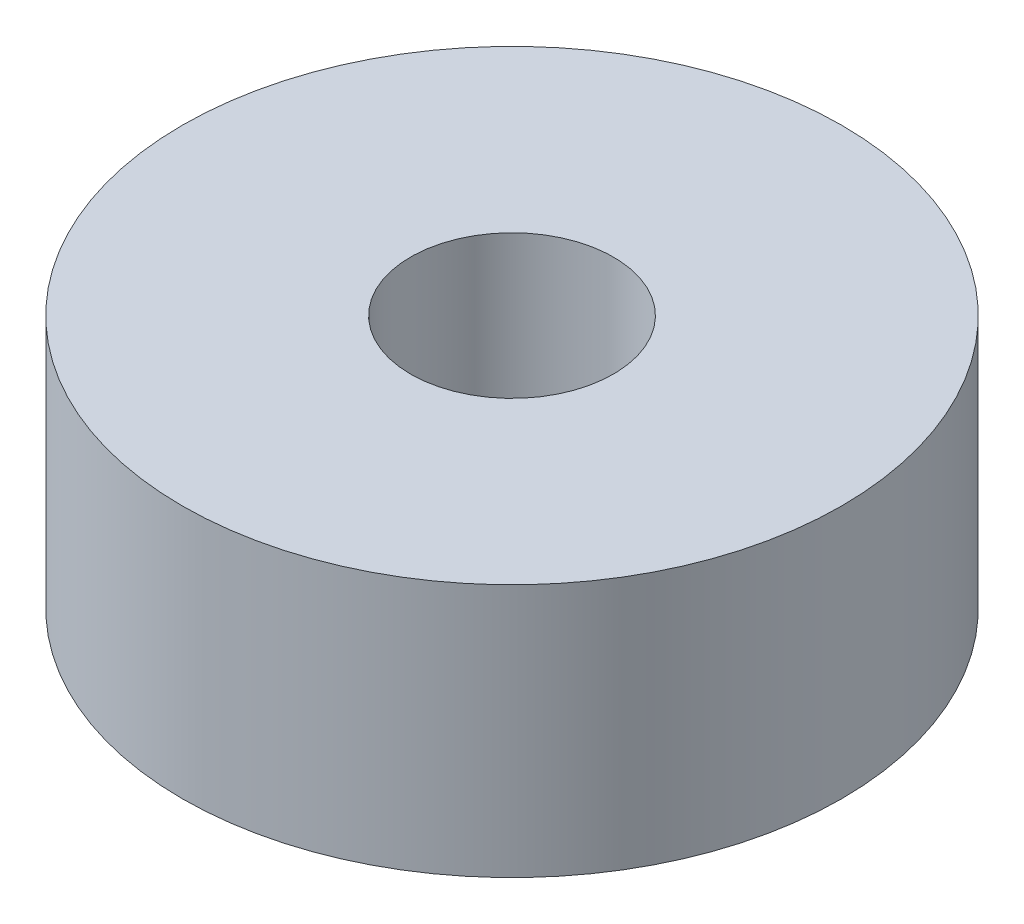
ISO-10303-21;
HEADER;
FILE_DESCRIPTION(('STEP AP214'),'2;1');
FILE_NAME('part.step','',(''),(''),'','','');
FILE_SCHEMA(('AUTOMOTIVE_DESIGN { 1 0 10303 214 1 1 1 1 }'));
ENDSEC;
DATA;
#1=APPLICATION_CONTEXT('core data for automotive mechanical design processes');
#2=APPLICATION_PROTOCOL_DEFINITION('international standard','automotive_design',2000,#1);
#3=PRODUCT_CONTEXT('',#1,'mechanical');
#4=PRODUCT('Part','Part','',(#3));
#5=PRODUCT_RELATED_PRODUCT_CATEGORY('part','',(#4));
#6=PRODUCT_DEFINITION_FORMATION('','',#4);
#7=PRODUCT_DEFINITION_CONTEXT('part definition',#1,'design');
#8=PRODUCT_DEFINITION('design','',#6,#7);
#9=PRODUCT_DEFINITION_SHAPE('','',#8);
#10=(LENGTH_UNIT() NAMED_UNIT(*) SI_UNIT(.MILLI.,.METRE.));
#11=(NAMED_UNIT(*) PLANE_ANGLE_UNIT() SI_UNIT($,.RADIAN.));
#12=(NAMED_UNIT(*) SI_UNIT($,.STERADIAN.) SOLID_ANGLE_UNIT());
#13=UNCERTAINTY_MEASURE_WITH_UNIT(LENGTH_MEASURE(1.E-05),#10,'distance_accuracy_value','');
#14=(GEOMETRIC_REPRESENTATION_CONTEXT(3) GLOBAL_UNCERTAINTY_ASSIGNED_CONTEXT((#13)) GLOBAL_UNIT_ASSIGNED_CONTEXT((#10,
#11,#12)) REPRESENTATION_CONTEXT('',''));
#15=CARTESIAN_POINT('',(0.,0.,0.));
#16=DIRECTION('',(0.,0.,1.));
#17=DIRECTION('',(1.,0.,0.));
#18=AXIS2_PLACEMENT_3D('',#15,#16,#17);
#19=CARTESIAN_POINT('',(0.,5.,0.));
#20=DIRECTION('',(0.,1.,0.));
#21=DIRECTION('',(0.,0.,1.));
#22=AXIS2_PLACEMENT_3D('',#19,#20,#21);
#23=PLANE('',#22);
#24=CARTESIAN_POINT('',(0.,5.,0.));
#25=DIRECTION('',(0.,1.,0.));
#26=DIRECTION('',(0.,0.,1.));
#27=AXIS2_PLACEMENT_3D('',#24,#25,#26);
#28=CIRCLE('',#27,6.5);
#29=CARTESIAN_POINT('',(0.,5.,6.5));
#30=VERTEX_POINT('',#29);
#31=EDGE_CURVE('E10',#30,#30,#28,.T.);
#32=ORIENTED_EDGE('',*,*,#31,.T.);
#33=EDGE_LOOP('',(#32));
#34=FACE_BOUND('',#33,.T.);
#35=CARTESIAN_POINT('',(0.,5.,0.));
#36=DIRECTION('',(0.,1.,0.));
#37=DIRECTION('',(0.,0.,1.));
#38=AXIS2_PLACEMENT_3D('',#35,#36,#37);
#39=CIRCLE('',#38,2.);
#40=CARTESIAN_POINT('',(0.,5.,2.));
#41=VERTEX_POINT('',#40);
#42=EDGE_CURVE('E50',#41,#41,#39,.T.);
#43=ORIENTED_EDGE('',*,*,#42,.F.);
#44=EDGE_LOOP('',(#43));
#45=FACE_BOUND('',#44,.T.);
#46=ADVANCED_FACE('F37',(#34,#45),#23,.T.);
#47=CARTESIAN_POINT('',(0.,0.,0.));
#48=DIRECTION('',(0.,1.,0.));
#49=DIRECTION('',(0.,0.,1.));
#50=AXIS2_PLACEMENT_3D('',#47,#48,#49);
#51=PLANE('',#50);
#52=CARTESIAN_POINT('',(0.,0.,0.));
#53=DIRECTION('',(0.,1.,0.));
#54=DIRECTION('',(0.,0.,1.));
#55=AXIS2_PLACEMENT_3D('',#52,#53,#54);
#56=CIRCLE('',#55,6.5);
#57=CARTESIAN_POINT('',(0.,0.,6.5));
#58=VERTEX_POINT('',#57);
#59=EDGE_CURVE('E41',#58,#58,#56,.T.);
#60=ORIENTED_EDGE('',*,*,#59,.F.);
#61=EDGE_LOOP('',(#60));
#62=FACE_BOUND('',#61,.T.);
#63=CARTESIAN_POINT('',(0.,0.,0.));
#64=DIRECTION('',(0.,1.,0.));
#65=DIRECTION('',(0.,0.,1.));
#66=AXIS2_PLACEMENT_3D('',#63,#64,#65);
#67=CIRCLE('',#66,2.);
#68=CARTESIAN_POINT('',(0.,0.,2.));
#69=VERTEX_POINT('',#68);
#70=EDGE_CURVE('E52',#69,#69,#67,.T.);
#71=ORIENTED_EDGE('',*,*,#70,.T.);
#72=EDGE_LOOP('',(#71));
#73=FACE_BOUND('',#72,.T.);
#74=ADVANCED_FACE('F64',(#62,#73),#51,.F.);
#75=CARTESIAN_POINT('',(0.,5.,0.));
#76=DIRECTION('',(0.,-1.,0.));
#77=DIRECTION('',(0.,0.,-1.));
#78=AXIS2_PLACEMENT_3D('',#75,#76,#77);
#79=CYLINDRICAL_SURFACE('',#78,6.5);
#80=ORIENTED_EDGE('',*,*,#31,.F.);
#81=EDGE_LOOP('',(#80));
#82=FACE_BOUND('',#81,.T.);
#83=ORIENTED_EDGE('',*,*,#59,.T.);
#84=EDGE_LOOP('',(#83));
#85=FACE_BOUND('',#84,.T.);
#86=ADVANCED_FACE('F39',(#82,#85),#79,.T.);
#87=CARTESIAN_POINT('',(0.,5.,0.));
#88=DIRECTION('',(0.,-1.,0.));
#89=DIRECTION('',(0.,0.,-1.));
#90=AXIS2_PLACEMENT_3D('',#87,#88,#89);
#91=CYLINDRICAL_SURFACE('',#90,2.);
#92=ORIENTED_EDGE('',*,*,#42,.T.);
#93=EDGE_LOOP('',(#92));
#94=FACE_BOUND('',#93,.T.);
#95=ORIENTED_EDGE('',*,*,#70,.F.);
#96=EDGE_LOOP('',(#95));
#97=FACE_BOUND('',#96,.T.);
#98=ADVANCED_FACE('F60',(#94,#97),#91,.F.);
#99=CLOSED_SHELL('',(#46,#74,#86,#98));
#100=MANIFOLD_SOLID_BREP('B2',#99);
#101=ADVANCED_BREP_SHAPE_REPRESENTATION('',(#18,#100),#14);
#102=SHAPE_DEFINITION_REPRESENTATION(#9,#101);
ENDSEC;
END-ISO-10303-21;
